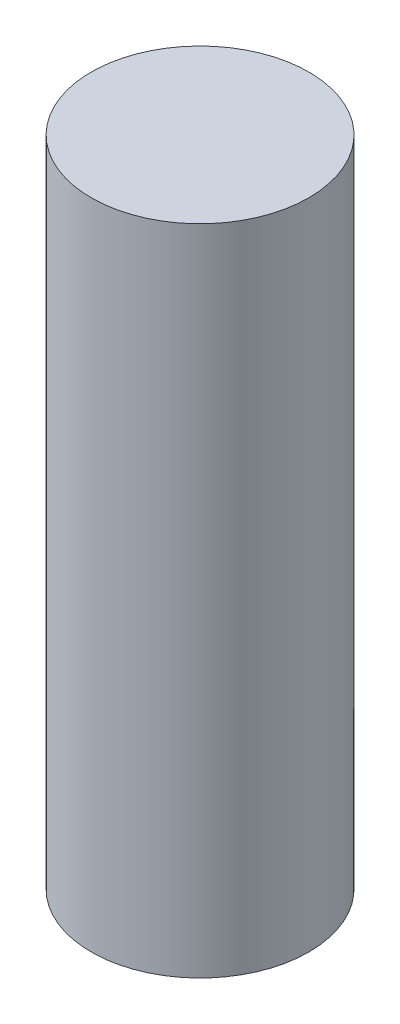
ISO-10303-21;
HEADER;
FILE_DESCRIPTION(('STEP AP214'),'2;1');
FILE_NAME('part.step','',(''),(''),'','','');
FILE_SCHEMA(('AUTOMOTIVE_DESIGN { 1 0 10303 214 1 1 1 1 }'));
ENDSEC;
DATA;
#1=APPLICATION_CONTEXT('core data for automotive mechanical design processes');
#2=APPLICATION_PROTOCOL_DEFINITION('international standard','automotive_design',2000,#1);
#3=PRODUCT_CONTEXT('',#1,'mechanical');
#4=PRODUCT('Part','Part','',(#3));
#5=PRODUCT_RELATED_PRODUCT_CATEGORY('part','',(#4));
#6=PRODUCT_DEFINITION_FORMATION('','',#4);
#7=PRODUCT_DEFINITION_CONTEXT('part definition',#1,'design');
#8=PRODUCT_DEFINITION('design','',#6,#7);
#9=PRODUCT_DEFINITION_SHAPE('','',#8);
#10=(LENGTH_UNIT() NAMED_UNIT(*) SI_UNIT(.MILLI.,.METRE.));
#11=(NAMED_UNIT(*) PLANE_ANGLE_UNIT() SI_UNIT($,.RADIAN.));
#12=(NAMED_UNIT(*) SI_UNIT($,.STERADIAN.) SOLID_ANGLE_UNIT());
#13=UNCERTAINTY_MEASURE_WITH_UNIT(LENGTH_MEASURE(1.E-05),#10,'distance_accuracy_value','');
#14=(GEOMETRIC_REPRESENTATION_CONTEXT(3) GLOBAL_UNCERTAINTY_ASSIGNED_CONTEXT((#13)) GLOBAL_UNIT_ASSIGNED_CONTEXT((#10,
#11,#12)) REPRESENTATION_CONTEXT('',''));
#15=CARTESIAN_POINT('',(0.,0.,0.));
#16=DIRECTION('',(0.,0.,1.));
#17=DIRECTION('',(1.,0.,0.));
#18=AXIS2_PLACEMENT_3D('',#15,#16,#17);
#19=CARTESIAN_POINT('',(29.0000000745058,53.,71.0000014156103));
#20=DIRECTION('',(0.,1.,0.));
#21=DIRECTION('',(1.,0.,0.));
#22=AXIS2_PLACEMENT_3D('',#19,#20,#21);
#23=PLANE('',#22);
#24=CARTESIAN_POINT('',(29.0000000745058,53.,71.0000014156103));
#25=DIRECTION('',(0.,1.,0.));
#26=DIRECTION('',(-1.,0.,0.));
#27=AXIS2_PLACEMENT_3D('',#24,#25,#26);
#28=CIRCLE('',#27,3.);
#29=CARTESIAN_POINT('',(32.0000000745058,53.,71.0000014156103));
#30=VERTEX_POINT('',#29);
#31=EDGE_CURVE('E11',#30,#30,#28,.T.);
#32=ORIENTED_EDGE('',*,*,#31,.F.);
#33=EDGE_LOOP('',(#32));
#34=FACE_BOUND('',#33,.T.);
#35=ADVANCED_FACE('F17',(#34),#23,.F.);
#36=CARTESIAN_POINT('',(29.0000000745058,71.,71.0000014156103));
#37=DIRECTION('',(0.,1.,0.));
#38=DIRECTION('',(1.,0.,0.));
#39=AXIS2_PLACEMENT_3D('',#36,#37,#38);
#40=PLANE('',#39);
#41=CARTESIAN_POINT('',(29.0000000745058,71.,71.0000014156103));
#42=DIRECTION('',(0.,1.,0.));
#43=DIRECTION('',(-1.,0.,0.));
#44=AXIS2_PLACEMENT_3D('',#41,#42,#43);
#45=CIRCLE('',#44,3.);
#46=CARTESIAN_POINT('',(32.0000000745058,71.,71.0000014156103));
#47=VERTEX_POINT('',#46);
#48=EDGE_CURVE('E43',#47,#47,#45,.T.);
#49=ORIENTED_EDGE('',*,*,#48,.T.);
#50=EDGE_LOOP('',(#49));
#51=FACE_BOUND('',#50,.T.);
#52=ADVANCED_FACE('F19',(#51),#40,.T.);
#53=CARTESIAN_POINT('',(29.0000000745058,53.,71.0000014156103));
#54=DIRECTION('',(0.,1.,0.));
#55=DIRECTION('',(-1.,0.,0.));
#56=AXIS2_PLACEMENT_3D('',#53,#54,#55);
#57=CYLINDRICAL_SURFACE('',#56,3.);
#58=ORIENTED_EDGE('',*,*,#48,.F.);
#59=DIRECTION('',(0.,-1.,0.));
#60=VECTOR('',#59,1.);
#61=CARTESIAN_POINT('',(32.0000000745058,53.,71.0000014156103));
#62=LINE('',#61,#60);
#63=EDGE_CURVE('E21',#47,#30,#62,.T.);
#64=ORIENTED_EDGE('',*,*,#63,.T.);
#65=ORIENTED_EDGE('',*,*,#31,.T.);
#66=ORIENTED_EDGE('',*,*,#63,.F.);
#67=EDGE_LOOP('',(#58,#64,#65,#66));
#68=FACE_BOUND('',#67,.T.);
#69=ADVANCED_FACE('F42',(#68),#57,.T.);
#70=CLOSED_SHELL('',(#35,#52,#69));
#71=MANIFOLD_SOLID_BREP('B1',#70);
#72=ADVANCED_BREP_SHAPE_REPRESENTATION('',(#18,#71),#14);
#73=SHAPE_DEFINITION_REPRESENTATION(#9,#72);
ENDSEC;
END-ISO-10303-21;
